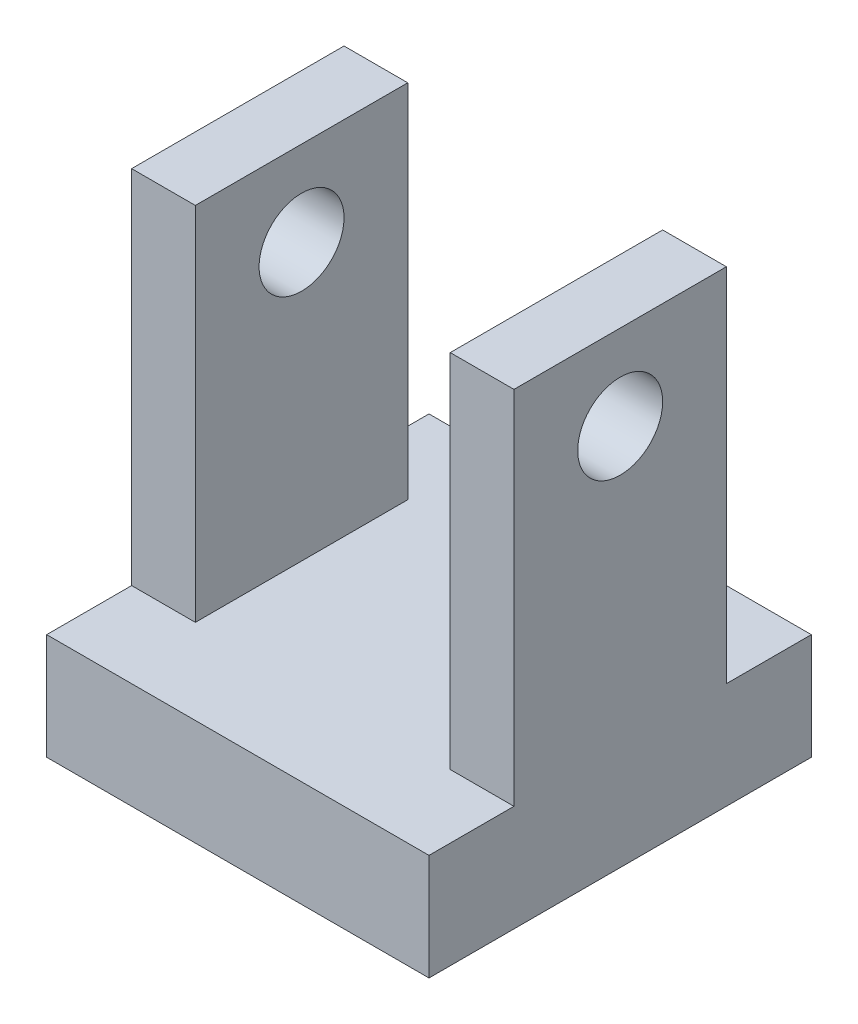
ISO-10303-21;
HEADER;
FILE_DESCRIPTION(('STEP AP214'),'2;1');
FILE_NAME('part.step','',(''),(''),'','','');
FILE_SCHEMA(('AUTOMOTIVE_DESIGN { 1 0 10303 214 1 1 1 1 }'));
ENDSEC;
DATA;
#1=APPLICATION_CONTEXT('core data for automotive mechanical design processes');
#2=APPLICATION_PROTOCOL_DEFINITION('international standard','automotive_design',2000,#1);
#3=PRODUCT_CONTEXT('',#1,'mechanical');
#4=PRODUCT('Part','Part','',(#3));
#5=PRODUCT_RELATED_PRODUCT_CATEGORY('part','',(#4));
#6=PRODUCT_DEFINITION_FORMATION('','',#4);
#7=PRODUCT_DEFINITION_CONTEXT('part definition',#1,'design');
#8=PRODUCT_DEFINITION('design','',#6,#7);
#9=PRODUCT_DEFINITION_SHAPE('','',#8);
#10=(LENGTH_UNIT() NAMED_UNIT(*) SI_UNIT(.MILLI.,.METRE.));
#11=(NAMED_UNIT(*) PLANE_ANGLE_UNIT() SI_UNIT($,.RADIAN.));
#12=(NAMED_UNIT(*) SI_UNIT($,.STERADIAN.) SOLID_ANGLE_UNIT());
#13=UNCERTAINTY_MEASURE_WITH_UNIT(LENGTH_MEASURE(1.E-05),#10,'distance_accuracy_value','');
#14=(GEOMETRIC_REPRESENTATION_CONTEXT(3) GLOBAL_UNCERTAINTY_ASSIGNED_CONTEXT((#13)) GLOBAL_UNIT_ASSIGNED_CONTEXT((#10,
#11,#12)) REPRESENTATION_CONTEXT('',''));
#15=CARTESIAN_POINT('',(0.,0.,0.));
#16=DIRECTION('',(0.,0.,1.));
#17=DIRECTION('',(1.,0.,0.));
#18=AXIS2_PLACEMENT_3D('',#15,#16,#17);
#19=CARTESIAN_POINT('',(45.,25.,-25.));
#20=DIRECTION('',(0.,0.,1.));
#21=DIRECTION('',(1.,0.,0.));
#22=AXIS2_PLACEMENT_3D('',#19,#20,#21);
#23=PLANE('',#22);
#24=DIRECTION('',(-1.,0.,0.));
#25=VECTOR('',#24,1.);
#26=CARTESIAN_POINT('',(45.,110.,-25.));
#27=LINE('',#26,#25);
#28=CARTESIAN_POINT('',(-30.,110.,-25.));
#29=VERTEX_POINT('',#28);
#30=CARTESIAN_POINT('',(-45.,110.,-25.));
#31=VERTEX_POINT('',#30);
#32=EDGE_CURVE('E134',#29,#31,#27,.T.);
#33=ORIENTED_EDGE('',*,*,#32,.F.);
#34=DIRECTION('',(0.,-1.,0.));
#35=VECTOR('',#34,1.);
#36=CARTESIAN_POINT('',(-30.,25.,-25.));
#37=LINE('',#36,#35);
#38=CARTESIAN_POINT('',(-30.,25.,-25.));
#39=VERTEX_POINT('',#38);
#40=EDGE_CURVE('E147',#29,#39,#37,.T.);
#41=ORIENTED_EDGE('',*,*,#40,.T.);
#42=DIRECTION('',(-1.,0.,0.));
#43=VECTOR('',#42,1.);
#44=CARTESIAN_POINT('',(45.,25.,-25.));
#45=LINE('',#44,#43);
#46=CARTESIAN_POINT('',(-45.,25.,-25.));
#47=VERTEX_POINT('',#46);
#48=EDGE_CURVE('E172',#39,#47,#45,.T.);
#49=ORIENTED_EDGE('',*,*,#48,.T.);
#50=DIRECTION('',(0.,1.,0.));
#51=VECTOR('',#50,1.);
#52=CARTESIAN_POINT('',(-45.,25.,-25.));
#53=LINE('',#52,#51);
#54=EDGE_CURVE('E155',#47,#31,#53,.T.);
#55=ORIENTED_EDGE('',*,*,#54,.T.);
#56=EDGE_LOOP('',(#33,#41,#49,#55));
#57=FACE_BOUND('',#56,.T.);
#58=ADVANCED_FACE('F33',(#57),#23,.F.);
#59=CARTESIAN_POINT('',(45.,110.,-25.));
#60=DIRECTION('',(0.,-1.,0.));
#61=DIRECTION('',(0.,0.,-1.));
#62=AXIS2_PLACEMENT_3D('',#59,#60,#61);
#63=PLANE('',#62);
#64=DIRECTION('',(-1.,0.,0.));
#65=VECTOR('',#64,1.);
#66=CARTESIAN_POINT('',(45.,110.,25.));
#67=LINE('',#66,#65);
#68=CARTESIAN_POINT('',(-30.,110.,25.));
#69=VERTEX_POINT('',#68);
#70=CARTESIAN_POINT('',(-45.,110.,25.));
#71=VERTEX_POINT('',#70);
#72=EDGE_CURVE('E135',#69,#71,#67,.T.);
#73=ORIENTED_EDGE('',*,*,#72,.F.);
#74=DIRECTION('',(0.,0.,1.));
#75=VECTOR('',#74,1.);
#76=CARTESIAN_POINT('',(-30.,110.,-45.));
#77=LINE('',#76,#75);
#78=EDGE_CURVE('E212',#29,#69,#77,.T.);
#79=ORIENTED_EDGE('',*,*,#78,.F.);
#80=ORIENTED_EDGE('',*,*,#32,.T.);
#81=DIRECTION('',(0.,0.,1.));
#82=VECTOR('',#81,1.);
#83=CARTESIAN_POINT('',(-45.,110.,-25.));
#84=LINE('',#83,#82);
#85=EDGE_CURVE('E158',#31,#71,#84,.T.);
#86=ORIENTED_EDGE('',*,*,#85,.T.);
#87=EDGE_LOOP('',(#73,#79,#80,#86));
#88=FACE_BOUND('',#87,.T.);
#89=ADVANCED_FACE('F245',(#88),#63,.F.);
#90=CARTESIAN_POINT('',(45.,110.,25.));
#91=DIRECTION('',(0.,0.,-1.));
#92=DIRECTION('',(0.,1.,0.));
#93=AXIS2_PLACEMENT_3D('',#90,#91,#92);
#94=PLANE('',#93);
#95=DIRECTION('',(-1.,0.,0.));
#96=VECTOR('',#95,1.);
#97=CARTESIAN_POINT('',(45.,25.,25.));
#98=LINE('',#97,#96);
#99=CARTESIAN_POINT('',(-30.,25.,25.));
#100=VERTEX_POINT('',#99);
#101=CARTESIAN_POINT('',(-45.,25.,25.));
#102=VERTEX_POINT('',#101);
#103=EDGE_CURVE('E168',#100,#102,#98,.T.);
#104=ORIENTED_EDGE('',*,*,#103,.F.);
#105=DIRECTION('',(0.,1.,0.));
#106=VECTOR('',#105,1.);
#107=CARTESIAN_POINT('',(-30.,110.,25.));
#108=LINE('',#107,#106);
#109=EDGE_CURVE('E204',#100,#69,#108,.T.);
#110=ORIENTED_EDGE('',*,*,#109,.T.);
#111=ORIENTED_EDGE('',*,*,#72,.T.);
#112=DIRECTION('',(0.,-1.,0.));
#113=VECTOR('',#112,1.);
#114=CARTESIAN_POINT('',(-45.,110.,25.));
#115=LINE('',#114,#113);
#116=EDGE_CURVE('E161',#71,#102,#115,.T.);
#117=ORIENTED_EDGE('',*,*,#116,.T.);
#118=EDGE_LOOP('',(#104,#110,#111,#117));
#119=FACE_BOUND('',#118,.T.);
#120=ADVANCED_FACE('F252',(#119),#94,.F.);
#121=CARTESIAN_POINT('',(45.,25.,45.));
#122=DIRECTION('',(0.,0.,-1.));
#123=DIRECTION('',(-1.,0.,0.));
#124=AXIS2_PLACEMENT_3D('',#121,#122,#123);
#125=PLANE('',#124);
#126=DIRECTION('',(0.,-1.,0.));
#127=VECTOR('',#126,1.);
#128=CARTESIAN_POINT('',(-45.,25.,45.));
#129=LINE('',#128,#127);
#130=CARTESIAN_POINT('',(-45.,25.,45.));
#131=VERTEX_POINT('',#130);
#132=CARTESIAN_POINT('',(-45.,0.,45.));
#133=VERTEX_POINT('',#132);
#134=EDGE_CURVE('E144',#131,#133,#129,.T.);
#135=ORIENTED_EDGE('',*,*,#134,.T.);
#136=DIRECTION('',(-1.,0.,0.));
#137=VECTOR('',#136,1.);
#138=CARTESIAN_POINT('',(45.,0.,45.));
#139=LINE('',#138,#137);
#140=CARTESIAN_POINT('',(45.,0.,45.));
#141=VERTEX_POINT('',#140);
#142=EDGE_CURVE('E11',#141,#133,#139,.T.);
#143=ORIENTED_EDGE('',*,*,#142,.F.);
#144=DIRECTION('',(0.,-1.,0.));
#145=VECTOR('',#144,1.);
#146=CARTESIAN_POINT('',(45.,25.,45.));
#147=LINE('',#146,#145);
#148=CARTESIAN_POINT('',(45.,25.,45.));
#149=VERTEX_POINT('',#148);
#150=EDGE_CURVE('E166',#149,#141,#147,.T.);
#151=ORIENTED_EDGE('',*,*,#150,.F.);
#152=DIRECTION('',(-1.,0.,0.));
#153=VECTOR('',#152,1.);
#154=CARTESIAN_POINT('',(45.,25.,45.));
#155=LINE('',#154,#153);
#156=EDGE_CURVE('E90',#149,#131,#155,.T.);
#157=ORIENTED_EDGE('',*,*,#156,.T.);
#158=EDGE_LOOP('',(#135,#143,#151,#157));
#159=FACE_BOUND('',#158,.T.);
#160=ADVANCED_FACE('F35',(#159),#125,.F.);
#161=CARTESIAN_POINT('',(45.,0.,45.));
#162=DIRECTION('',(0.,1.,0.));
#163=DIRECTION('',(0.,0.,1.));
#164=AXIS2_PLACEMENT_3D('',#161,#162,#163);
#165=PLANE('',#164);
#166=DIRECTION('',(0.,0.,-1.));
#167=VECTOR('',#166,1.);
#168=CARTESIAN_POINT('',(-45.,0.,45.));
#169=LINE('',#168,#167);
#170=CARTESIAN_POINT('',(-45.,0.,-45.));
#171=VERTEX_POINT('',#170);
#172=EDGE_CURVE('E146',#133,#171,#169,.T.);
#173=ORIENTED_EDGE('',*,*,#172,.T.);
#174=DIRECTION('',(-1.,0.,0.));
#175=VECTOR('',#174,1.);
#176=CARTESIAN_POINT('',(45.,0.,-45.));
#177=LINE('',#176,#175);
#178=CARTESIAN_POINT('',(45.,0.,-45.));
#179=VERTEX_POINT('',#178);
#180=EDGE_CURVE('E42',#179,#171,#177,.T.);
#181=ORIENTED_EDGE('',*,*,#180,.F.);
#182=DIRECTION('',(0.,0.,-1.));
#183=VECTOR('',#182,1.);
#184=CARTESIAN_POINT('',(45.,0.,45.));
#185=LINE('',#184,#183);
#186=EDGE_CURVE('E98',#141,#179,#185,.T.);
#187=ORIENTED_EDGE('',*,*,#186,.F.);
#188=ORIENTED_EDGE('',*,*,#142,.T.);
#189=EDGE_LOOP('',(#173,#181,#187,#188));
#190=FACE_BOUND('',#189,.T.);
#191=ADVANCED_FACE('F263',(#190),#165,.F.);
#192=CARTESIAN_POINT('',(45.,0.,-45.));
#193=DIRECTION('',(0.,0.,1.));
#194=DIRECTION('',(0.,-1.,0.));
#195=AXIS2_PLACEMENT_3D('',#192,#193,#194);
#196=PLANE('',#195);
#197=DIRECTION('',(0.,1.,0.));
#198=VECTOR('',#197,1.);
#199=CARTESIAN_POINT('',(-45.,0.,-45.));
#200=LINE('',#199,#198);
#201=CARTESIAN_POINT('',(-45.,25.,-45.));
#202=VERTEX_POINT('',#201);
#203=EDGE_CURVE('E149',#171,#202,#200,.T.);
#204=ORIENTED_EDGE('',*,*,#203,.T.);
#205=DIRECTION('',(-1.,0.,0.));
#206=VECTOR('',#205,1.);
#207=CARTESIAN_POINT('',(45.,25.,-45.));
#208=LINE('',#207,#206);
#209=CARTESIAN_POINT('',(45.,25.,-45.));
#210=VERTEX_POINT('',#209);
#211=EDGE_CURVE('E176',#210,#202,#208,.T.);
#212=ORIENTED_EDGE('',*,*,#211,.F.);
#213=DIRECTION('',(0.,1.,0.));
#214=VECTOR('',#213,1.);
#215=CARTESIAN_POINT('',(45.,0.,-45.));
#216=LINE('',#215,#214);
#217=EDGE_CURVE('E185',#179,#210,#216,.T.);
#218=ORIENTED_EDGE('',*,*,#217,.F.);
#219=ORIENTED_EDGE('',*,*,#180,.T.);
#220=EDGE_LOOP('',(#204,#212,#218,#219));
#221=FACE_BOUND('',#220,.T.);
#222=ADVANCED_FACE('F182',(#221),#196,.F.);
#223=CARTESIAN_POINT('',(45.,25.,-25.));
#224=VERTEX_POINT('',#223);
#225=CARTESIAN_POINT('',(30.,25.,-25.));
#226=VERTEX_POINT('',#225);
#227=EDGE_CURVE('E173',#224,#226,#45,.T.);
#228=ORIENTED_EDGE('',*,*,#227,.T.);
#229=DIRECTION('',(0.,1.,0.));
#230=VECTOR('',#229,1.);
#231=CARTESIAN_POINT('',(30.,25.,-25.));
#232=LINE('',#231,#230);
#233=CARTESIAN_POINT('',(30.,110.,-25.));
#234=VERTEX_POINT('',#233);
#235=EDGE_CURVE('E207',#226,#234,#232,.T.);
#236=ORIENTED_EDGE('',*,*,#235,.T.);
#237=CARTESIAN_POINT('',(45.,110.,-25.));
#238=VERTEX_POINT('',#237);
#239=EDGE_CURVE('E170',#238,#234,#27,.T.);
#240=ORIENTED_EDGE('',*,*,#239,.F.);
#241=DIRECTION('',(0.,1.,0.));
#242=VECTOR('',#241,1.);
#243=CARTESIAN_POINT('',(45.,25.,-25.));
#244=LINE('',#243,#242);
#245=EDGE_CURVE('E120',#224,#238,#244,.T.);
#246=ORIENTED_EDGE('',*,*,#245,.F.);
#247=EDGE_LOOP('',(#228,#236,#240,#246));
#248=FACE_BOUND('',#247,.T.);
#249=ADVANCED_FACE('F248',(#248),#23,.F.);
#250=ORIENTED_EDGE('',*,*,#239,.T.);
#251=DIRECTION('',(0.,0.,1.));
#252=VECTOR('',#251,1.);
#253=CARTESIAN_POINT('',(30.,110.,-45.));
#254=LINE('',#253,#252);
#255=CARTESIAN_POINT('',(30.,110.,25.));
#256=VERTEX_POINT('',#255);
#257=EDGE_CURVE('E131',#234,#256,#254,.T.);
#258=ORIENTED_EDGE('',*,*,#257,.T.);
#259=CARTESIAN_POINT('',(45.,110.,25.));
#260=VERTEX_POINT('',#259);
#261=EDGE_CURVE('E127',#260,#256,#67,.T.);
#262=ORIENTED_EDGE('',*,*,#261,.F.);
#263=DIRECTION('',(0.,0.,1.));
#264=VECTOR('',#263,1.);
#265=CARTESIAN_POINT('',(45.,110.,-25.));
#266=LINE('',#265,#264);
#267=EDGE_CURVE('E113',#238,#260,#266,.T.);
#268=ORIENTED_EDGE('',*,*,#267,.F.);
#269=EDGE_LOOP('',(#250,#258,#262,#268));
#270=FACE_BOUND('',#269,.T.);
#271=ADVANCED_FACE('F128',(#270),#63,.F.);
#272=ORIENTED_EDGE('',*,*,#261,.T.);
#273=DIRECTION('',(0.,-1.,0.));
#274=VECTOR('',#273,1.);
#275=CARTESIAN_POINT('',(30.,110.,25.));
#276=LINE('',#275,#274);
#277=CARTESIAN_POINT('',(30.,25.,25.));
#278=VERTEX_POINT('',#277);
#279=EDGE_CURVE('E210',#256,#278,#276,.T.);
#280=ORIENTED_EDGE('',*,*,#279,.T.);
#281=CARTESIAN_POINT('',(45.,25.,25.));
#282=VERTEX_POINT('',#281);
#283=EDGE_CURVE('E139',#282,#278,#98,.T.);
#284=ORIENTED_EDGE('',*,*,#283,.F.);
#285=DIRECTION('',(0.,-1.,0.));
#286=VECTOR('',#285,1.);
#287=CARTESIAN_POINT('',(45.,110.,25.));
#288=LINE('',#287,#286);
#289=EDGE_CURVE('E117',#260,#282,#288,.T.);
#290=ORIENTED_EDGE('',*,*,#289,.F.);
#291=EDGE_LOOP('',(#272,#280,#284,#290));
#292=FACE_BOUND('',#291,.T.);
#293=ADVANCED_FACE('F137',(#292),#94,.F.);
#294=CARTESIAN_POINT('',(45.,25.,25.));
#295=DIRECTION('',(0.,-1.,0.));
#296=DIRECTION('',(0.,0.,-1.));
#297=AXIS2_PLACEMENT_3D('',#294,#295,#296);
#298=PLANE('',#297);
#299=ORIENTED_EDGE('',*,*,#283,.T.);
#300=DIRECTION('',(0.,0.,1.));
#301=VECTOR('',#300,1.);
#302=CARTESIAN_POINT('',(30.,25.,-45.));
#303=LINE('',#302,#301);
#304=EDGE_CURVE('E214',#226,#278,#303,.T.);
#305=ORIENTED_EDGE('',*,*,#304,.F.);
#306=ORIENTED_EDGE('',*,*,#227,.F.);
#307=DIRECTION('',(0.,0.,1.));
#308=VECTOR('',#307,1.);
#309=CARTESIAN_POINT('',(45.,25.,-45.));
#310=LINE('',#309,#308);
#311=EDGE_CURVE('E195',#210,#224,#310,.T.);
#312=ORIENTED_EDGE('',*,*,#311,.F.);
#313=ORIENTED_EDGE('',*,*,#211,.T.);
#314=DIRECTION('',(0.,0.,1.));
#315=VECTOR('',#314,1.);
#316=CARTESIAN_POINT('',(-45.,25.,-45.));
#317=LINE('',#316,#315);
#318=EDGE_CURVE('E152',#202,#47,#317,.T.);
#319=ORIENTED_EDGE('',*,*,#318,.T.);
#320=ORIENTED_EDGE('',*,*,#48,.F.);
#321=DIRECTION('',(0.,0.,1.));
#322=VECTOR('',#321,1.);
#323=CARTESIAN_POINT('',(-30.,25.,-45.));
#324=LINE('',#323,#322);
#325=EDGE_CURVE('E49',#39,#100,#324,.T.);
#326=ORIENTED_EDGE('',*,*,#325,.T.);
#327=ORIENTED_EDGE('',*,*,#103,.T.);
#328=DIRECTION('',(0.,0.,1.));
#329=VECTOR('',#328,1.);
#330=CARTESIAN_POINT('',(-45.,25.,25.));
#331=LINE('',#330,#329);
#332=EDGE_CURVE('E164',#102,#131,#331,.T.);
#333=ORIENTED_EDGE('',*,*,#332,.T.);
#334=ORIENTED_EDGE('',*,*,#156,.F.);
#335=DIRECTION('',(0.,0.,1.));
#336=VECTOR('',#335,1.);
#337=CARTESIAN_POINT('',(45.,25.,25.));
#338=LINE('',#337,#336);
#339=EDGE_CURVE('E58',#282,#149,#338,.T.);
#340=ORIENTED_EDGE('',*,*,#339,.F.);
#341=EDGE_LOOP('',(#299,#305,#306,#312,#313,#319,#320,#326,#327,#333,#334,#340));
#342=FACE_BOUND('',#341,.T.);
#343=ADVANCED_FACE('F191',(#342),#298,.F.);
#344=CARTESIAN_POINT('',(45.,0.,0.));
#345=DIRECTION('',(1.,0.,0.));
#346=DIRECTION('',(0.,0.,-1.));
#347=AXIS2_PLACEMENT_3D('',#344,#345,#346);
#348=PLANE('',#347);
#349=CARTESIAN_POINT('',(45.,90.,0.));
#350=DIRECTION('',(1.,0.,0.));
#351=DIRECTION('',(0.,0.,-1.));
#352=AXIS2_PLACEMENT_3D('',#349,#350,#351);
#353=CIRCLE('',#352,10.);
#354=CARTESIAN_POINT('',(45.,90.,-10.));
#355=VERTEX_POINT('',#354);
#356=EDGE_CURVE('E226',#355,#355,#353,.T.);
#357=ORIENTED_EDGE('',*,*,#356,.F.);
#358=EDGE_LOOP('',(#357));
#359=FACE_BOUND('',#358,.T.);
#360=ORIENTED_EDGE('',*,*,#150,.T.);
#361=ORIENTED_EDGE('',*,*,#186,.T.);
#362=ORIENTED_EDGE('',*,*,#217,.T.);
#363=ORIENTED_EDGE('',*,*,#311,.T.);
#364=ORIENTED_EDGE('',*,*,#245,.T.);
#365=ORIENTED_EDGE('',*,*,#267,.T.);
#366=ORIENTED_EDGE('',*,*,#289,.T.);
#367=ORIENTED_EDGE('',*,*,#339,.T.);
#368=EDGE_LOOP('',(#360,#361,#362,#363,#364,#365,#366,#367));
#369=FACE_BOUND('',#368,.T.);
#370=ADVANCED_FACE('F115',(#359,#369),#348,.T.);
#371=CARTESIAN_POINT('',(-45.,0.,0.));
#372=DIRECTION('',(1.,0.,0.));
#373=DIRECTION('',(0.,0.,-1.));
#374=AXIS2_PLACEMENT_3D('',#371,#372,#373);
#375=PLANE('',#374);
#376=CARTESIAN_POINT('',(-45.,90.,0.));
#377=DIRECTION('',(1.,0.,0.));
#378=DIRECTION('',(0.,0.,-1.));
#379=AXIS2_PLACEMENT_3D('',#376,#377,#378);
#380=CIRCLE('',#379,10.);
#381=CARTESIAN_POINT('',(-45.,90.,-10.));
#382=VERTEX_POINT('',#381);
#383=EDGE_CURVE('E223',#382,#382,#380,.T.);
#384=ORIENTED_EDGE('',*,*,#383,.T.);
#385=EDGE_LOOP('',(#384));
#386=FACE_BOUND('',#385,.T.);
#387=ORIENTED_EDGE('',*,*,#134,.F.);
#388=ORIENTED_EDGE('',*,*,#332,.F.);
#389=ORIENTED_EDGE('',*,*,#116,.F.);
#390=ORIENTED_EDGE('',*,*,#85,.F.);
#391=ORIENTED_EDGE('',*,*,#54,.F.);
#392=ORIENTED_EDGE('',*,*,#318,.F.);
#393=ORIENTED_EDGE('',*,*,#203,.F.);
#394=ORIENTED_EDGE('',*,*,#172,.F.);
#395=EDGE_LOOP('',(#387,#388,#389,#390,#391,#392,#393,#394));
#396=FACE_BOUND('',#395,.T.);
#397=ADVANCED_FACE('F188',(#386,#396),#375,.F.);
#398=CARTESIAN_POINT('',(-30.,25.,-45.));
#399=DIRECTION('',(-1.,0.,0.));
#400=DIRECTION('',(0.,0.,1.));
#401=AXIS2_PLACEMENT_3D('',#398,#399,#400);
#402=PLANE('',#401);
#403=CARTESIAN_POINT('',(-30.,90.,0.));
#404=DIRECTION('',(-1.,0.,0.));
#405=DIRECTION('',(0.,0.,1.));
#406=AXIS2_PLACEMENT_3D('',#403,#404,#405);
#407=CIRCLE('',#406,10.);
#408=CARTESIAN_POINT('',(-30.,90.,-10.));
#409=VERTEX_POINT('',#408);
#410=EDGE_CURVE('E215',#409,#409,#407,.T.);
#411=ORIENTED_EDGE('',*,*,#410,.T.);
#412=EDGE_LOOP('',(#411));
#413=FACE_BOUND('',#412,.T.);
#414=ORIENTED_EDGE('',*,*,#78,.T.);
#415=ORIENTED_EDGE('',*,*,#109,.F.);
#416=ORIENTED_EDGE('',*,*,#325,.F.);
#417=ORIENTED_EDGE('',*,*,#40,.F.);
#418=EDGE_LOOP('',(#414,#415,#416,#417));
#419=FACE_BOUND('',#418,.T.);
#420=ADVANCED_FACE('F239',(#413,#419),#402,.F.);
#421=CARTESIAN_POINT('',(30.,25.,-45.));
#422=DIRECTION('',(1.,0.,0.));
#423=DIRECTION('',(0.,0.,-1.));
#424=AXIS2_PLACEMENT_3D('',#421,#422,#423);
#425=PLANE('',#424);
#426=CARTESIAN_POINT('',(30.,90.,0.));
#427=DIRECTION('',(1.,0.,0.));
#428=DIRECTION('',(0.,0.,-1.));
#429=AXIS2_PLACEMENT_3D('',#426,#427,#428);
#430=CIRCLE('',#429,10.);
#431=CARTESIAN_POINT('',(30.,90.,-10.));
#432=VERTEX_POINT('',#431);
#433=EDGE_CURVE('E37',#432,#432,#430,.T.);
#434=ORIENTED_EDGE('',*,*,#433,.T.);
#435=EDGE_LOOP('',(#434));
#436=FACE_BOUND('',#435,.T.);
#437=ORIENTED_EDGE('',*,*,#304,.T.);
#438=ORIENTED_EDGE('',*,*,#279,.F.);
#439=ORIENTED_EDGE('',*,*,#257,.F.);
#440=ORIENTED_EDGE('',*,*,#235,.F.);
#441=EDGE_LOOP('',(#437,#438,#439,#440));
#442=FACE_BOUND('',#441,.T.);
#443=ADVANCED_FACE('F326',(#436,#442),#425,.F.);
#444=CARTESIAN_POINT('',(-45.,90.,0.));
#445=DIRECTION('',(1.,0.,0.));
#446=DIRECTION('',(0.,0.,-1.));
#447=AXIS2_PLACEMENT_3D('',#444,#445,#446);
#448=CYLINDRICAL_SURFACE('',#447,10.);
#449=CARTESIAN_POINT('',(45.,90.,-10.));
#450=CARTESIAN_POINT('',(44.84375,90.,-10.));
#451=CARTESIAN_POINT('',(44.6875,90.,-10.));
#452=CARTESIAN_POINT('',(44.375,90.,-10.));
#453=CARTESIAN_POINT('',(44.21875,90.,-10.));
#454=CARTESIAN_POINT('',(43.90625,90.,-10.));
#455=CARTESIAN_POINT('',(43.75,90.,-10.));
#456=CARTESIAN_POINT('',(43.4375,90.,-10.));
#457=CARTESIAN_POINT('',(43.28125,90.,-10.));
#458=CARTESIAN_POINT('',(42.96875,90.,-10.));
#459=CARTESIAN_POINT('',(42.8125,90.,-10.));
#460=CARTESIAN_POINT('',(42.5,90.,-10.));
#461=CARTESIAN_POINT('',(42.34375,90.,-10.));
#462=CARTESIAN_POINT('',(42.03125,90.,-10.));
#463=CARTESIAN_POINT('',(41.875,90.,-10.));
#464=CARTESIAN_POINT('',(41.5625,90.,-10.));
#465=CARTESIAN_POINT('',(41.40625,90.,-10.));
#466=CARTESIAN_POINT('',(41.09375,90.,-10.));
#467=CARTESIAN_POINT('',(40.9375,90.,-10.));
#468=CARTESIAN_POINT('',(40.625,90.,-10.));
#469=CARTESIAN_POINT('',(40.46875,90.,-10.));
#470=CARTESIAN_POINT('',(40.15625,90.,-10.));
#471=CARTESIAN_POINT('',(40.,90.,-10.));
#472=CARTESIAN_POINT('',(39.6875,90.,-10.));
#473=CARTESIAN_POINT('',(39.53125,90.,-10.));
#474=CARTESIAN_POINT('',(39.21875,90.,-10.));
#475=CARTESIAN_POINT('',(39.0625,90.,-10.));
#476=CARTESIAN_POINT('',(38.75,90.,-10.));
#477=CARTESIAN_POINT('',(38.59375,90.,-10.));
#478=CARTESIAN_POINT('',(38.28125,90.,-10.));
#479=CARTESIAN_POINT('',(38.125,90.,-10.));
#480=CARTESIAN_POINT('',(37.8125,90.,-10.));
#481=CARTESIAN_POINT('',(37.65625,90.,-10.));
#482=CARTESIAN_POINT('',(37.34375,90.,-10.));
#483=CARTESIAN_POINT('',(37.1875,90.,-10.));
#484=CARTESIAN_POINT('',(36.875,90.,-10.));
#485=CARTESIAN_POINT('',(36.71875,90.,-10.));
#486=CARTESIAN_POINT('',(36.40625,90.,-10.));
#487=CARTESIAN_POINT('',(36.25,90.,-10.));
#488=CARTESIAN_POINT('',(35.9375,90.,-10.));
#489=CARTESIAN_POINT('',(35.78125,90.,-10.));
#490=CARTESIAN_POINT('',(35.46875,90.,-10.));
#491=CARTESIAN_POINT('',(35.3125,90.,-10.));
#492=CARTESIAN_POINT('',(35.,90.,-10.));
#493=CARTESIAN_POINT('',(34.84375,90.,-10.));
#494=CARTESIAN_POINT('',(34.53125,90.,-10.));
#495=CARTESIAN_POINT('',(34.375,90.,-10.));
#496=CARTESIAN_POINT('',(34.0625,90.,-10.));
#497=CARTESIAN_POINT('',(33.90625,90.,-10.));
#498=CARTESIAN_POINT('',(33.59375,90.,-10.));
#499=CARTESIAN_POINT('',(33.4375,90.,-10.));
#500=CARTESIAN_POINT('',(33.125,90.,-10.));
#501=CARTESIAN_POINT('',(32.96875,90.,-10.));
#502=CARTESIAN_POINT('',(32.65625,90.,-10.));
#503=CARTESIAN_POINT('',(32.5,90.,-10.));
#504=CARTESIAN_POINT('',(32.1875,90.,-10.));
#505=CARTESIAN_POINT('',(32.03125,90.,-10.));
#506=CARTESIAN_POINT('',(31.71875,90.,-10.));
#507=CARTESIAN_POINT('',(31.5625,90.,-10.));
#508=CARTESIAN_POINT('',(31.25,90.,-10.));
#509=CARTESIAN_POINT('',(31.09375,90.,-10.));
#510=CARTESIAN_POINT('',(30.78125,90.,-10.));
#511=CARTESIAN_POINT('',(30.625,90.,-10.));
#512=CARTESIAN_POINT('',(30.3125,90.,-10.));
#513=CARTESIAN_POINT('',(30.15625,90.,-10.));
#514=CARTESIAN_POINT('',(30.,90.,-10.));
#515=B_SPLINE_CURVE_WITH_KNOTS('',3,(#449,#450,#451,#452,#453,#454,#455,#456,#457,#458,#459,
#460,#461,#462,#463,#464,#465,#466,#467,#468,#469,#470,#471,#472,#473,#474,#475,#476,#477,#478,
#479,#480,#481,#482,#483,#484,#485,#486,#487,#488,#489,#490,#491,#492,#493,#494,#495,#496,#497,
#498,#499,#500,#501,#502,#503,#504,#505,#506,#507,#508,#509,#510,#511,#512,#513,#514),
.UNSPECIFIED.,.F.,.F.,(4,2,2,2,2,2,2,2,2,2,2,2,2,2,2,2,2,2,2,2,2,2,2,2,2,2,2,2,2,2,2,2,4),(0.,
0.468750000000004,0.937500000000008,1.40625,1.875,2.34375000000001,2.8125,3.28125,3.75,
4.21875000000001,4.68750000000001,5.15625,5.62500000000001,6.09375000000001,6.5625,7.03125,
7.50000000000001,7.96875000000001,8.43750000000001,8.90625,9.37500000000001,9.84375000000001,
10.3125,10.78125,11.25,11.71875,12.1875,12.65625,13.125,13.59375,14.0625,14.53125,15.),.UNSPECIFIED.);
#516=EDGE_CURVE('BSEAM230',#355,#432,#515,.T.);
#517=ORIENTED_EDGE('',*,*,#356,.T.);
#518=ORIENTED_EDGE('',*,*,#433,.F.);
#519=ORIENTED_EDGE('',*,*,#516,.T.);
#520=ORIENTED_EDGE('',*,*,#516,.F.);
#521=EDGE_LOOP('',(#517,#519,#518,#520));
#522=FACE_BOUND('',#521,.T.);
#523=ADVANCED_FACE('F230',(#522),#448,.F.);
#524=CARTESIAN_POINT('',(-45.,90.,-10.));
#525=CARTESIAN_POINT('',(-44.84375,90.,-10.));
#526=CARTESIAN_POINT('',(-44.6875,90.,-10.));
#527=CARTESIAN_POINT('',(-44.375,90.,-10.));
#528=CARTESIAN_POINT('',(-44.21875,90.,-10.));
#529=CARTESIAN_POINT('',(-43.90625,90.,-10.));
#530=CARTESIAN_POINT('',(-43.75,90.,-10.));
#531=CARTESIAN_POINT('',(-43.4375,90.,-10.));
#532=CARTESIAN_POINT('',(-43.28125,90.,-10.));
#533=CARTESIAN_POINT('',(-42.96875,90.,-10.));
#534=CARTESIAN_POINT('',(-42.8125,90.,-10.));
#535=CARTESIAN_POINT('',(-42.5,90.,-10.));
#536=CARTESIAN_POINT('',(-42.34375,90.,-10.));
#537=CARTESIAN_POINT('',(-42.03125,90.,-10.));
#538=CARTESIAN_POINT('',(-41.875,90.,-10.));
#539=CARTESIAN_POINT('',(-41.5625,90.,-10.));
#540=CARTESIAN_POINT('',(-41.40625,90.,-10.));
#541=CARTESIAN_POINT('',(-41.09375,90.,-10.));
#542=CARTESIAN_POINT('',(-40.9375,90.,-10.));
#543=CARTESIAN_POINT('',(-40.625,90.,-10.));
#544=CARTESIAN_POINT('',(-40.46875,90.,-10.));
#545=CARTESIAN_POINT('',(-40.15625,90.,-10.));
#546=CARTESIAN_POINT('',(-40.,90.,-10.));
#547=CARTESIAN_POINT('',(-39.6875,90.,-10.));
#548=CARTESIAN_POINT('',(-39.53125,90.,-10.));
#549=CARTESIAN_POINT('',(-39.21875,90.,-10.));
#550=CARTESIAN_POINT('',(-39.0625,90.,-10.));
#551=CARTESIAN_POINT('',(-38.75,90.,-10.));
#552=CARTESIAN_POINT('',(-38.59375,90.,-10.));
#553=CARTESIAN_POINT('',(-38.28125,90.,-10.));
#554=CARTESIAN_POINT('',(-38.125,90.,-10.));
#555=CARTESIAN_POINT('',(-37.8125,90.,-10.));
#556=CARTESIAN_POINT('',(-37.65625,90.,-10.));
#557=CARTESIAN_POINT('',(-37.34375,90.,-10.));
#558=CARTESIAN_POINT('',(-37.1875,90.,-10.));
#559=CARTESIAN_POINT('',(-36.875,90.,-10.));
#560=CARTESIAN_POINT('',(-36.71875,90.,-10.));
#561=CARTESIAN_POINT('',(-36.40625,90.,-10.));
#562=CARTESIAN_POINT('',(-36.25,90.,-10.));
#563=CARTESIAN_POINT('',(-35.9375,90.,-10.));
#564=CARTESIAN_POINT('',(-35.78125,90.,-10.));
#565=CARTESIAN_POINT('',(-35.46875,90.,-10.));
#566=CARTESIAN_POINT('',(-35.3125,90.,-10.));
#567=CARTESIAN_POINT('',(-35.,90.,-10.));
#568=CARTESIAN_POINT('',(-34.84375,90.,-10.));
#569=CARTESIAN_POINT('',(-34.53125,90.,-10.));
#570=CARTESIAN_POINT('',(-34.375,90.,-10.));
#571=CARTESIAN_POINT('',(-34.0625,90.,-10.));
#572=CARTESIAN_POINT('',(-33.90625,90.,-10.));
#573=CARTESIAN_POINT('',(-33.59375,90.,-10.));
#574=CARTESIAN_POINT('',(-33.4375,90.,-10.));
#575=CARTESIAN_POINT('',(-33.125,90.,-10.));
#576=CARTESIAN_POINT('',(-32.96875,90.,-10.));
#577=CARTESIAN_POINT('',(-32.65625,90.,-10.));
#578=CARTESIAN_POINT('',(-32.5,90.,-10.));
#579=CARTESIAN_POINT('',(-32.1875,90.,-10.));
#580=CARTESIAN_POINT('',(-32.03125,90.,-10.));
#581=CARTESIAN_POINT('',(-31.71875,90.,-10.));
#582=CARTESIAN_POINT('',(-31.5625,90.,-10.));
#583=CARTESIAN_POINT('',(-31.25,90.,-10.));
#584=CARTESIAN_POINT('',(-31.09375,90.,-10.));
#585=CARTESIAN_POINT('',(-30.78125,90.,-10.));
#586=CARTESIAN_POINT('',(-30.625,90.,-10.));
#587=CARTESIAN_POINT('',(-30.3125,90.,-10.));
#588=CARTESIAN_POINT('',(-30.15625,90.,-10.));
#589=CARTESIAN_POINT('',(-30.,90.,-10.));
#590=B_SPLINE_CURVE_WITH_KNOTS('',3,(#524,#525,#526,#527,#528,#529,#530,#531,#532,#533,#534,
#535,#536,#537,#538,#539,#540,#541,#542,#543,#544,#545,#546,#547,#548,#549,#550,#551,#552,#553,
#554,#555,#556,#557,#558,#559,#560,#561,#562,#563,#564,#565,#566,#567,#568,#569,#570,#571,#572,
#573,#574,#575,#576,#577,#578,#579,#580,#581,#582,#583,#584,#585,#586,#587,#588,#589),
.UNSPECIFIED.,.F.,.F.,(4,2,2,2,2,2,2,2,2,2,2,2,2,2,2,2,2,2,2,2,2,2,2,2,2,2,2,2,2,2,2,2,4),(0.,
0.468749999999997,0.937499999999994,1.40625,1.87499999999999,2.34375,2.8125,3.28125,3.75,
4.21875,4.6875,5.15625,5.625,6.09374999999999,6.5625,7.03125,7.5,7.96875,8.4375,8.90625,9.375,
9.84375,10.3125,10.78125,11.25,11.71875,12.1875,12.65625,13.125,13.59375,14.0625,14.53125,15.),.UNSPECIFIED.);
#591=EDGE_CURVE('BSEAM344',#382,#409,#590,.T.);
#592=ORIENTED_EDGE('',*,*,#383,.F.);
#593=ORIENTED_EDGE('',*,*,#410,.F.);
#594=ORIENTED_EDGE('',*,*,#591,.T.);
#595=ORIENTED_EDGE('',*,*,#591,.F.);
#596=EDGE_LOOP('',(#592,#594,#593,#595));
#597=FACE_BOUND('',#596,.T.);
#598=ADVANCED_FACE('F344',(#597),#448,.F.);
#599=CLOSED_SHELL('',(#58,#89,#120,#160,#191,#222,#249,#271,#293,#343,#370,#397,#420,#443,#523,#598));
#600=MANIFOLD_SOLID_BREP('B2',#599);
#601=ADVANCED_BREP_SHAPE_REPRESENTATION('',(#18,#600),#14);
#602=SHAPE_DEFINITION_REPRESENTATION(#9,#601);
ENDSEC;
END-ISO-10303-21;
